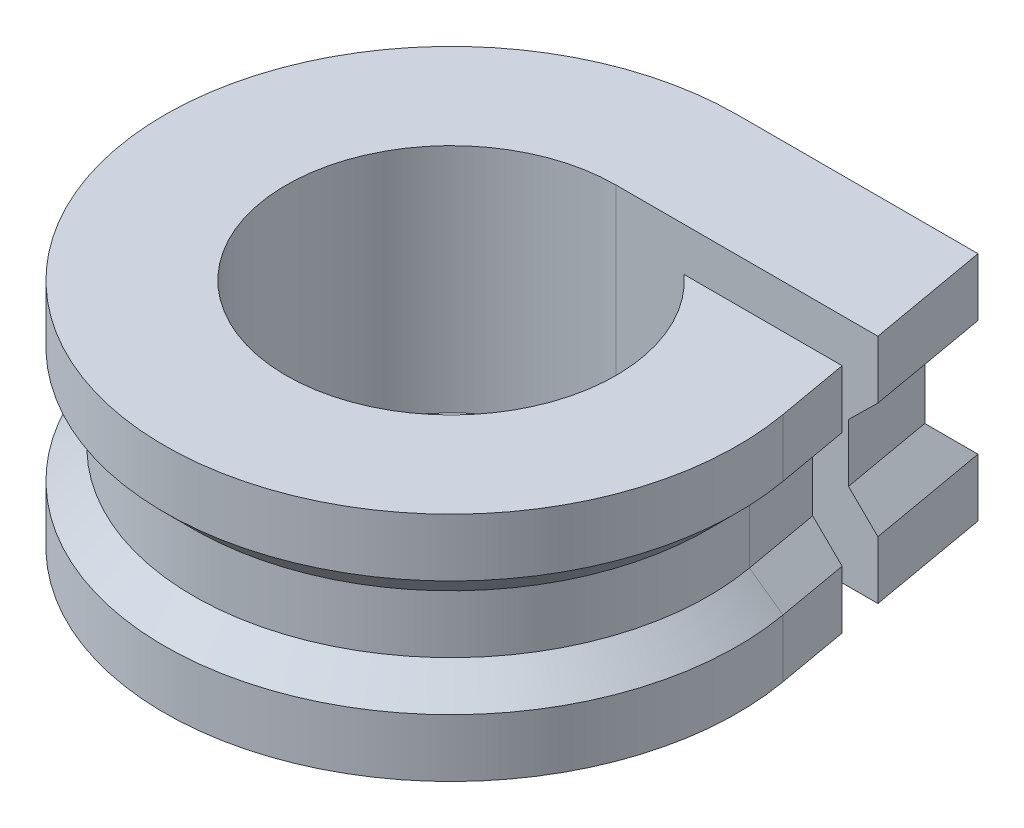
ISO-10303-21;
HEADER;
FILE_DESCRIPTION(('STEP AP214'),'2;1');
FILE_NAME('part.step','',(''),(''),'','','');
FILE_SCHEMA(('AUTOMOTIVE_DESIGN { 1 0 10303 214 1 1 1 1 }'));
ENDSEC;
DATA;
#1=APPLICATION_CONTEXT('core data for automotive mechanical design processes');
#2=APPLICATION_PROTOCOL_DEFINITION('international standard','automotive_design',2000,#1);
#3=PRODUCT_CONTEXT('',#1,'mechanical');
#4=PRODUCT('Part','Part','',(#3));
#5=PRODUCT_RELATED_PRODUCT_CATEGORY('part','',(#4));
#6=PRODUCT_DEFINITION_FORMATION('','',#4);
#7=PRODUCT_DEFINITION_CONTEXT('part definition',#1,'design');
#8=PRODUCT_DEFINITION('design','',#6,#7);
#9=PRODUCT_DEFINITION_SHAPE('','',#8);
#10=(LENGTH_UNIT() NAMED_UNIT(*) SI_UNIT(.MILLI.,.METRE.));
#11=(NAMED_UNIT(*) PLANE_ANGLE_UNIT() SI_UNIT($,.RADIAN.));
#12=(NAMED_UNIT(*) SI_UNIT($,.STERADIAN.) SOLID_ANGLE_UNIT());
#13=UNCERTAINTY_MEASURE_WITH_UNIT(LENGTH_MEASURE(1.E-05),#10,'distance_accuracy_value','');
#14=(GEOMETRIC_REPRESENTATION_CONTEXT(3) GLOBAL_UNCERTAINTY_ASSIGNED_CONTEXT((#13)) GLOBAL_UNIT_ASSIGNED_CONTEXT((#10,
#11,#12)) REPRESENTATION_CONTEXT('',''));
#15=CARTESIAN_POINT('',(0.,0.,0.));
#16=DIRECTION('',(0.,0.,1.));
#17=DIRECTION('',(1.,0.,0.));
#18=AXIS2_PLACEMENT_3D('',#15,#16,#17);
#19=CARTESIAN_POINT('',(0.,3.,-9.9));
#20=DIRECTION('',(0.,0.,-1.));
#21=DIRECTION('',(-1.,0.,0.));
#22=AXIS2_PLACEMENT_3D('',#19,#20,#21);
#23=PLANE('',#22);
#24=DIRECTION('',(0.,-1.,0.));
#25=VECTOR('',#24,1.);
#26=CARTESIAN_POINT('',(0.,3.,-9.9));
#27=LINE('',#26,#25);
#28=CARTESIAN_POINT('',(0.,1.99999999999999,-9.9));
#29=VERTEX_POINT('',#28);
#30=CARTESIAN_POINT('',(0.,0.,-9.9));
#31=VERTEX_POINT('',#30);
#32=EDGE_CURVE('E261',#29,#31,#27,.T.);
#33=ORIENTED_EDGE('',*,*,#32,.F.);
#34=DIRECTION('',(1.,0.,0.));
#35=VECTOR('',#34,1.);
#36=CARTESIAN_POINT('',(0.,1.99999999999999,-9.9));
#37=LINE('',#36,#35);
#38=CARTESIAN_POINT('',(8.3070863486551,1.99999999999999,-9.9));
#39=VERTEX_POINT('',#38);
#40=EDGE_CURVE('E275',#29,#39,#37,.T.);
#41=ORIENTED_EDGE('',*,*,#40,.T.);
#42=DIRECTION('',(0.,-1.,0.));
#43=VECTOR('',#42,1.);
#44=CARTESIAN_POINT('',(8.3070863486551,3.,-9.9));
#45=LINE('',#44,#43);
#46=CARTESIAN_POINT('',(8.3070863486551,0.,-9.9));
#47=VERTEX_POINT('',#46);
#48=EDGE_CURVE('E249',#39,#47,#45,.T.);
#49=ORIENTED_EDGE('',*,*,#48,.T.);
#50=DIRECTION('',(1.,0.,0.));
#51=VECTOR('',#50,1.);
#52=CARTESIAN_POINT('',(0.,0.,-9.9));
#53=LINE('',#52,#51);
#54=EDGE_CURVE('E230',#31,#47,#53,.T.);
#55=ORIENTED_EDGE('',*,*,#54,.F.);
#56=EDGE_LOOP('',(#33,#41,#49,#55));
#57=FACE_BOUND('',#56,.T.);
#58=ADVANCED_FACE('F41',(#57),#23,.T.);
#59=CARTESIAN_POINT('',(0.,3.,0.));
#60=DIRECTION('',(0.,-1.,0.));
#61=DIRECTION('',(0.,0.,-1.));
#62=AXIS2_PLACEMENT_3D('',#59,#60,#61);
#63=CYLINDRICAL_SURFACE('',#62,9.9);
#64=DIRECTION('',(0.,-1.,0.));
#65=VECTOR('',#64,1.);
#66=CARTESIAN_POINT('',(9.74959675482087,3.,-1.71911695890258));
#67=LINE('',#66,#65);
#68=CARTESIAN_POINT('',(9.74959675482087,1.99999999999999,-1.71911695890258));
#69=VERTEX_POINT('',#68);
#70=CARTESIAN_POINT('',(9.74959675482087,0.,-1.71911695890258));
#71=VERTEX_POINT('',#70);
#72=EDGE_CURVE('E259',#69,#71,#67,.T.);
#73=ORIENTED_EDGE('',*,*,#72,.F.);
#74=CARTESIAN_POINT('',(0.,1.99999999999999,0.));
#75=DIRECTION('',(0.,1.,0.));
#76=DIRECTION('',(0.,0.,1.));
#77=AXIS2_PLACEMENT_3D('',#74,#75,#76);
#78=CIRCLE('',#77,9.9);
#79=EDGE_CURVE('E11',#69,#29,#78,.F.);
#80=ORIENTED_EDGE('',*,*,#79,.T.);
#81=ORIENTED_EDGE('',*,*,#32,.T.);
#82=CARTESIAN_POINT('',(0.,0.,0.));
#83=DIRECTION('',(0.,1.,0.));
#84=DIRECTION('',(0.,0.,1.));
#85=AXIS2_PLACEMENT_3D('',#82,#83,#84);
#86=CIRCLE('',#85,9.9);
#87=EDGE_CURVE('E233',#31,#71,#86,.T.);
#88=ORIENTED_EDGE('',*,*,#87,.T.);
#89=EDGE_LOOP('',(#73,#80,#81,#88));
#90=FACE_BOUND('',#89,.T.);
#91=ADVANCED_FACE('F378',(#90),#63,.T.);
#92=CARTESIAN_POINT('',(9.74959675482087,3.,-1.71911695890258));
#93=DIRECTION('',(0.984807753012208,0.,-0.173648177666927));
#94=DIRECTION('',(-0.173648177666927,0.,-0.984807753012209));
#95=AXIS2_PLACEMENT_3D('',#92,#93,#94);
#96=PLANE('',#95);
#97=DIRECTION('',(0.,-1.,0.));
#98=VECTOR('',#97,1.);
#99=CARTESIAN_POINT('',(9.31215013869334,3.,-4.2));
#100=LINE('',#99,#98);
#101=CARTESIAN_POINT('',(9.31215013869334,1.99999999999999,-4.2));
#102=VERTEX_POINT('',#101);
#103=CARTESIAN_POINT('',(9.31215013869334,0.,-4.2));
#104=VERTEX_POINT('',#103);
#105=EDGE_CURVE('E257',#102,#104,#100,.T.);
#106=ORIENTED_EDGE('',*,*,#105,.F.);
#107=DIRECTION('',(0.173648177666927,0.,0.984807753012209));
#108=VECTOR('',#107,1.);
#109=CARTESIAN_POINT('',(9.74959675482087,1.99999999999999,-1.71911695890258));
#110=LINE('',#109,#108);
#111=EDGE_CURVE('E59',#102,#69,#110,.T.);
#112=ORIENTED_EDGE('',*,*,#111,.T.);
#113=ORIENTED_EDGE('',*,*,#72,.T.);
#114=DIRECTION('',(0.173648177666927,0.,0.984807753012209));
#115=VECTOR('',#114,1.);
#116=CARTESIAN_POINT('',(9.74959675482087,0.,-1.71911695890258));
#117=LINE('',#116,#115);
#118=EDGE_CURVE('E236',#104,#71,#117,.T.);
#119=ORIENTED_EDGE('',*,*,#118,.F.);
#120=EDGE_LOOP('',(#106,#112,#113,#119));
#121=FACE_BOUND('',#120,.T.);
#122=ADVANCED_FACE('F380',(#121),#96,.T.);
#123=CARTESIAN_POINT('',(0.,3.,-4.2));
#124=DIRECTION('',(0.,0.,-1.));
#125=DIRECTION('',(-1.,0.,0.));
#126=AXIS2_PLACEMENT_3D('',#123,#124,#125);
#127=PLANE('',#126);
#128=DIRECTION('',(0.,-1.,0.));
#129=VECTOR('',#128,1.);
#130=CARTESIAN_POINT('',(3.85356977359954,3.,-4.2));
#131=LINE('',#130,#129);
#132=CARTESIAN_POINT('',(3.85356977359954,8.,-4.2));
#133=VERTEX_POINT('',#132);
#134=CARTESIAN_POINT('',(3.85356977359954,0.,-4.2));
#135=VERTEX_POINT('',#134);
#136=EDGE_CURVE('E255',#133,#135,#131,.T.);
#137=ORIENTED_EDGE('',*,*,#136,.F.);
#138=DIRECTION('',(1.,0.,0.));
#139=VECTOR('',#138,1.);
#140=CARTESIAN_POINT('',(0.,8.,-4.2));
#141=LINE('',#140,#139);
#142=CARTESIAN_POINT('',(9.31215013869334,8.,-4.2));
#143=VERTEX_POINT('',#142);
#144=EDGE_CURVE('E331',#133,#143,#141,.T.);
#145=ORIENTED_EDGE('',*,*,#144,.T.);
#146=DIRECTION('',(0.,1.,0.));
#147=VECTOR('',#146,1.);
#148=CARTESIAN_POINT('',(9.31215013869334,5.,-4.2));
#149=LINE('',#148,#147);
#150=CARTESIAN_POINT('',(9.31215013869334,6.00000000000001,-4.2));
#151=VERTEX_POINT('',#150);
#152=EDGE_CURVE('E301',#151,#143,#149,.T.);
#153=ORIENTED_EDGE('',*,*,#152,.F.);
#154=DIRECTION('',(-0.712498293208668,-0.701673843159865,0.));
#155=VECTOR('',#154,1.);
#156=CARTESIAN_POINT('',(4.08486015298302,0.852124294829388,-4.2));
#157=LINE('',#156,#155);
#158=CARTESIAN_POINT('',(8.29672352680759,5.,-4.2));
#159=VERTEX_POINT('',#158);
#160=EDGE_CURVE('E206',#159,#151,#157,.F.);
#161=ORIENTED_EDGE('',*,*,#160,.F.);
#162=DIRECTION('',(0.,-1.,0.));
#163=VECTOR('',#162,1.);
#164=CARTESIAN_POINT('',(8.29672352680759,4.,-4.2));
#165=LINE('',#164,#163);
#166=CARTESIAN_POINT('',(8.29672352680759,3.,-4.2));
#167=VERTEX_POINT('',#166);
#168=EDGE_CURVE('E211',#159,#167,#165,.T.);
#169=ORIENTED_EDGE('',*,*,#168,.T.);
#170=DIRECTION('',(-0.712498293208668,0.701673843159865,0.));
#171=VECTOR('',#170,1.);
#172=CARTESIAN_POINT('',(4.08486015298302,7.14787570517061,-4.2));
#173=LINE('',#172,#171);
#174=EDGE_CURVE('E51',#167,#102,#173,.F.);
#175=ORIENTED_EDGE('',*,*,#174,.T.);
#176=ORIENTED_EDGE('',*,*,#105,.T.);
#177=DIRECTION('',(1.,0.,0.));
#178=VECTOR('',#177,1.);
#179=CARTESIAN_POINT('',(0.,0.,-4.2));
#180=LINE('',#179,#178);
#181=EDGE_CURVE('E239',#135,#104,#180,.T.);
#182=ORIENTED_EDGE('',*,*,#181,.F.);
#183=EDGE_LOOP('',(#137,#145,#153,#161,#169,#175,#176,#182));
#184=FACE_BOUND('',#183,.T.);
#185=ADVANCED_FACE('F298',(#184),#127,.T.);
#186=CARTESIAN_POINT('',(0.,3.,0.));
#187=DIRECTION('',(0.,-1.,0.));
#188=DIRECTION('',(0.,0.,-1.));
#189=AXIS2_PLACEMENT_3D('',#186,#187,#188);
#190=CYLINDRICAL_SURFACE('',#189,5.7);
#191=CARTESIAN_POINT('',(0.,0.,0.));
#192=DIRECTION('',(0.,1.,0.));
#193=DIRECTION('',(0.,0.,1.));
#194=AXIS2_PLACEMENT_3D('',#191,#192,#193);
#195=CIRCLE('',#194,5.7);
#196=CARTESIAN_POINT('',(0.,0.,-5.7));
#197=VERTEX_POINT('',#196);
#198=EDGE_CURVE('E243',#197,#135,#195,.T.);
#199=ORIENTED_EDGE('',*,*,#198,.F.);
#200=DIRECTION('',(0.,-1.,0.));
#201=VECTOR('',#200,1.);
#202=CARTESIAN_POINT('',(0.,3.,-5.7));
#203=LINE('',#202,#201);
#204=CARTESIAN_POINT('',(0.,8.,-5.7));
#205=VERTEX_POINT('',#204);
#206=EDGE_CURVE('E253',#205,#197,#203,.T.);
#207=ORIENTED_EDGE('',*,*,#206,.F.);
#208=CARTESIAN_POINT('',(0.,8.,0.));
#209=DIRECTION('',(0.,1.,0.));
#210=DIRECTION('',(0.,0.,1.));
#211=AXIS2_PLACEMENT_3D('',#208,#209,#210);
#212=CIRCLE('',#211,5.7);
#213=EDGE_CURVE('E328',#205,#133,#212,.T.);
#214=ORIENTED_EDGE('',*,*,#213,.T.);
#215=ORIENTED_EDGE('',*,*,#136,.T.);
#216=EDGE_LOOP('',(#199,#207,#214,#215));
#217=FACE_BOUND('',#216,.T.);
#218=ADVANCED_FACE('F384',(#217),#190,.F.);
#219=CARTESIAN_POINT('',(0.,3.,-5.7));
#220=DIRECTION('',(0.,0.,-1.));
#221=DIRECTION('',(-1.,0.,0.));
#222=AXIS2_PLACEMENT_3D('',#219,#220,#221);
#223=PLANE('',#222);
#224=DIRECTION('',(0.,-1.,0.));
#225=VECTOR('',#224,1.);
#226=CARTESIAN_POINT('',(9.04765966763064,3.,-5.7));
#227=LINE('',#226,#225);
#228=CARTESIAN_POINT('',(9.04765966763064,2.,-5.7));
#229=VERTEX_POINT('',#228);
#230=CARTESIAN_POINT('',(9.04765966763064,0.,-5.7));
#231=VERTEX_POINT('',#230);
#232=EDGE_CURVE('E251',#229,#231,#227,.T.);
#233=ORIENTED_EDGE('',*,*,#232,.F.);
#234=DIRECTION('',(0.71249829320867,-0.701673843159863,0.));
#235=VECTOR('',#234,1.);
#236=CARTESIAN_POINT('',(9.40400070981591,1.6490725789395,-5.7));
#237=LINE('',#236,#235);
#238=CARTESIAN_POINT('',(8.0322330557449,3.,-5.7));
#239=VERTEX_POINT('',#238);
#240=EDGE_CURVE('E170',#229,#239,#237,.F.);
#241=ORIENTED_EDGE('',*,*,#240,.T.);
#242=DIRECTION('',(0.,-1.,0.));
#243=VECTOR('',#242,1.);
#244=CARTESIAN_POINT('',(8.0322330557449,4.,-5.7));
#245=LINE('',#244,#243);
#246=CARTESIAN_POINT('',(8.0322330557449,5.,-5.7));
#247=VERTEX_POINT('',#246);
#248=EDGE_CURVE('E162',#247,#239,#245,.T.);
#249=ORIENTED_EDGE('',*,*,#248,.F.);
#250=DIRECTION('',(0.71249829320867,0.701673843159863,0.));
#251=VECTOR('',#250,1.);
#252=CARTESIAN_POINT('',(9.40400070981591,6.3509274210605,-5.7));
#253=LINE('',#252,#251);
#254=CARTESIAN_POINT('',(9.04765966763064,6.,-5.7));
#255=VERTEX_POINT('',#254);
#256=EDGE_CURVE('E168',#255,#247,#253,.F.);
#257=ORIENTED_EDGE('',*,*,#256,.F.);
#258=DIRECTION('',(0.,1.,0.));
#259=VECTOR('',#258,1.);
#260=CARTESIAN_POINT('',(9.04765966763064,5.,-5.7));
#261=LINE('',#260,#259);
#262=CARTESIAN_POINT('',(9.04765966763064,8.,-5.7));
#263=VERTEX_POINT('',#262);
#264=EDGE_CURVE('E317',#255,#263,#261,.T.);
#265=ORIENTED_EDGE('',*,*,#264,.T.);
#266=DIRECTION('',(1.,0.,0.));
#267=VECTOR('',#266,1.);
#268=CARTESIAN_POINT('',(0.,8.,-5.7));
#269=LINE('',#268,#267);
#270=EDGE_CURVE('E325',#205,#263,#269,.T.);
#271=ORIENTED_EDGE('',*,*,#270,.F.);
#272=ORIENTED_EDGE('',*,*,#206,.T.);
#273=DIRECTION('',(1.,0.,0.));
#274=VECTOR('',#273,1.);
#275=CARTESIAN_POINT('',(0.,0.,-5.7));
#276=LINE('',#275,#274);
#277=EDGE_CURVE('E246',#197,#231,#276,.T.);
#278=ORIENTED_EDGE('',*,*,#277,.T.);
#279=EDGE_LOOP('',(#233,#241,#249,#257,#265,#271,#272,#278));
#280=FACE_BOUND('',#279,.T.);
#281=ADVANCED_FACE('F165',(#280),#223,.F.);
#282=ORIENTED_EDGE('',*,*,#48,.F.);
#283=DIRECTION('',(0.173648177666927,0.,0.984807753012209));
#284=VECTOR('',#283,1.);
#285=CARTESIAN_POINT('',(9.74959675482087,2.,-1.71911695890258));
#286=LINE('',#285,#284);
#287=EDGE_CURVE('E263',#39,#229,#286,.T.);
#288=ORIENTED_EDGE('',*,*,#287,.T.);
#289=ORIENTED_EDGE('',*,*,#232,.T.);
#290=EDGE_CURVE('E240',#47,#231,#117,.T.);
#291=ORIENTED_EDGE('',*,*,#290,.F.);
#292=EDGE_LOOP('',(#282,#288,#289,#291));
#293=FACE_BOUND('',#292,.T.);
#294=ADVANCED_FACE('F366',(#293),#96,.T.);
#295=CARTESIAN_POINT('',(0.,0.,0.));
#296=DIRECTION('',(0.,1.,0.));
#297=DIRECTION('',(0.,0.,1.));
#298=AXIS2_PLACEMENT_3D('',#295,#296,#297);
#299=PLANE('',#298);
#300=ORIENTED_EDGE('',*,*,#54,.T.);
#301=ORIENTED_EDGE('',*,*,#290,.T.);
#302=ORIENTED_EDGE('',*,*,#277,.F.);
#303=ORIENTED_EDGE('',*,*,#198,.T.);
#304=ORIENTED_EDGE('',*,*,#181,.T.);
#305=ORIENTED_EDGE('',*,*,#118,.T.);
#306=ORIENTED_EDGE('',*,*,#87,.F.);
#307=EDGE_LOOP('',(#300,#301,#302,#303,#304,#305,#306));
#308=FACE_BOUND('',#307,.T.);
#309=ADVANCED_FACE('F372',(#308),#299,.F.);
#310=CARTESIAN_POINT('',(9.74959675482087,1.99999999999999,-1.71911695890258));
#311=DIRECTION('',(-0.696364240320021,-0.707106781186546,0.122787803968971));
#312=DIRECTION('',(0.173648177666927,0.,0.984807753012209));
#313=AXIS2_PLACEMENT_3D('',#310,#311,#312);
#314=PLANE('',#313);
#315=ORIENTED_EDGE('',*,*,#174,.F.);
#316=DIRECTION('',(-0.173648177666927,0.,-0.984807753012209));
#317=VECTOR('',#316,1.);
#318=CARTESIAN_POINT('',(8.76478900180866,3.,-1.54546878123565));
#319=LINE('',#318,#317);
#320=CARTESIAN_POINT('',(8.76478900180865,3.,-1.54546878123566));
#321=VERTEX_POINT('',#320);
#322=EDGE_CURVE('E269',#321,#167,#319,.T.);
#323=ORIENTED_EDGE('',*,*,#322,.F.);
#324=DIRECTION('',(-0.696364240320018,0.707106781186549,0.12278780396897));
#325=VECTOR('',#324,1.);
#326=CARTESIAN_POINT('',(9.74959675482087,1.99999999999999,-1.71911695890258));
#327=LINE('',#326,#325);
#328=EDGE_CURVE('E46',#69,#321,#327,.T.);
#329=ORIENTED_EDGE('',*,*,#328,.F.);
#330=ORIENTED_EDGE('',*,*,#111,.F.);
#331=EDGE_LOOP('',(#315,#323,#329,#330));
#332=FACE_BOUND('',#331,.T.);
#333=ADVANCED_FACE('F44',(#332),#314,.F.);
#334=CARTESIAN_POINT('',(0.,3.,0.));
#335=DIRECTION('',(0.,-1.,0.));
#336=DIRECTION('',(0.,0.,-1.));
#337=AXIS2_PLACEMENT_3D('',#334,#335,#336);
#338=CONICAL_SURFACE('',#337,8.9,0.785398163397447);
#339=ORIENTED_EDGE('',*,*,#328,.T.);
#340=CARTESIAN_POINT('',(0.,3.,0.));
#341=DIRECTION('',(0.,1.,0.));
#342=DIRECTION('',(0.,0.,1.));
#343=AXIS2_PLACEMENT_3D('',#340,#341,#342);
#344=CIRCLE('',#343,8.9);
#345=CARTESIAN_POINT('',(0.,3.,-8.9));
#346=VERTEX_POINT('',#345);
#347=EDGE_CURVE('E267',#346,#321,#344,.T.);
#348=ORIENTED_EDGE('',*,*,#347,.F.);
#349=DIRECTION('',(0.,0.707106781186548,0.707106781186547));
#350=VECTOR('',#349,1.);
#351=CARTESIAN_POINT('',(0.,1.99999999999999,-9.9));
#352=LINE('',#351,#350);
#353=EDGE_CURVE('E280',#29,#346,#352,.T.);
#354=ORIENTED_EDGE('',*,*,#353,.F.);
#355=ORIENTED_EDGE('',*,*,#79,.F.);
#356=EDGE_LOOP('',(#339,#348,#354,#355));
#357=FACE_BOUND('',#356,.T.);
#358=ADVANCED_FACE('F291',(#357),#338,.T.);
#359=CARTESIAN_POINT('',(0.,1.99999999999999,-9.9));
#360=DIRECTION('',(0.,-0.707106781186547,0.707106781186548));
#361=DIRECTION('',(1.,0.,0.));
#362=AXIS2_PLACEMENT_3D('',#359,#360,#361);
#363=PLANE('',#362);
#364=ORIENTED_EDGE('',*,*,#353,.T.);
#365=DIRECTION('',(-1.,0.,0.));
#366=VECTOR('',#365,1.);
#367=CARTESIAN_POINT('',(0.,3.,-8.9));
#368=LINE('',#367,#366);
#369=CARTESIAN_POINT('',(7.46798671747782,3.,-8.9));
#370=VERTEX_POINT('',#369);
#371=EDGE_CURVE('E271',#370,#346,#368,.T.);
#372=ORIENTED_EDGE('',*,*,#371,.F.);
#373=DIRECTION('',(0.510273605374739,-0.608120402411342,-0.608120402411341));
#374=VECTOR('',#373,1.);
#375=CARTESIAN_POINT('',(6.14409424675937,4.57775360818713,-7.32224639181287));
#376=LINE('',#375,#374);
#377=EDGE_CURVE('E173',#39,#370,#376,.F.);
#378=ORIENTED_EDGE('',*,*,#377,.F.);
#379=ORIENTED_EDGE('',*,*,#40,.F.);
#380=EDGE_LOOP('',(#364,#372,#378,#379));
#381=FACE_BOUND('',#380,.T.);
#382=ADVANCED_FACE('F360',(#381),#363,.F.);
#383=CARTESIAN_POINT('',(9.74959675482087,2.,-1.71911695890258));
#384=DIRECTION('',(-0.696364240320019,-0.707106781186548,0.12278780396897));
#385=DIRECTION('',(0.173648177666927,0.,0.984807753012209));
#386=AXIS2_PLACEMENT_3D('',#383,#384,#385);
#387=PLANE('',#386);
#388=ORIENTED_EDGE('',*,*,#377,.T.);
#389=DIRECTION('',(-0.173648177666927,0.,-0.984807753012209));
#390=VECTOR('',#389,1.);
#391=CARTESIAN_POINT('',(8.76478900180866,3.,-1.54546878123565));
#392=LINE('',#391,#390);
#393=EDGE_CURVE('E273',#239,#370,#392,.T.);
#394=ORIENTED_EDGE('',*,*,#393,.F.);
#395=ORIENTED_EDGE('',*,*,#240,.F.);
#396=ORIENTED_EDGE('',*,*,#287,.F.);
#397=EDGE_LOOP('',(#388,#394,#395,#396));
#398=FACE_BOUND('',#397,.T.);
#399=ADVANCED_FACE('F363',(#398),#387,.F.);
#400=CARTESIAN_POINT('',(8.0322330557449,4.,-5.7));
#401=DIRECTION('',(-0.984807753012209,0.,0.173648177666927));
#402=DIRECTION('',(0.173648177666927,0.,0.984807753012209));
#403=AXIS2_PLACEMENT_3D('',#400,#401,#402);
#404=PLANE('',#403);
#405=ORIENTED_EDGE('',*,*,#393,.T.);
#406=DIRECTION('',(0.,-1.,0.));
#407=VECTOR('',#406,1.);
#408=CARTESIAN_POINT('',(7.46798671747782,4.,-8.9));
#409=LINE('',#408,#407);
#410=CARTESIAN_POINT('',(7.46798671747782,5.,-8.9));
#411=VERTEX_POINT('',#410);
#412=EDGE_CURVE('E174',#411,#370,#409,.T.);
#413=ORIENTED_EDGE('',*,*,#412,.F.);
#414=DIRECTION('',(-0.173648177666927,0.,-0.984807753012209));
#415=VECTOR('',#414,1.);
#416=CARTESIAN_POINT('',(8.76478900180866,5.,-1.54546878123565));
#417=LINE('',#416,#415);
#418=EDGE_CURVE('E177',#247,#411,#417,.T.);
#419=ORIENTED_EDGE('',*,*,#418,.F.);
#420=ORIENTED_EDGE('',*,*,#248,.T.);
#421=EDGE_LOOP('',(#405,#413,#419,#420));
#422=FACE_BOUND('',#421,.T.);
#423=ADVANCED_FACE('F178',(#422),#404,.F.);
#424=CARTESIAN_POINT('',(7.46798671747782,4.,-8.9));
#425=DIRECTION('',(0.,0.,1.));
#426=DIRECTION('',(1.,0.,0.));
#427=AXIS2_PLACEMENT_3D('',#424,#425,#426);
#428=PLANE('',#427);
#429=ORIENTED_EDGE('',*,*,#371,.T.);
#430=DIRECTION('',(0.,-1.,0.));
#431=VECTOR('',#430,1.);
#432=CARTESIAN_POINT('',(0.,4.,-8.9));
#433=LINE('',#432,#431);
#434=CARTESIAN_POINT('',(0.,5.,-8.9));
#435=VERTEX_POINT('',#434);
#436=EDGE_CURVE('E226',#435,#346,#433,.T.);
#437=ORIENTED_EDGE('',*,*,#436,.F.);
#438=DIRECTION('',(-1.,0.,0.));
#439=VECTOR('',#438,1.);
#440=CARTESIAN_POINT('',(0.,5.,-8.9));
#441=LINE('',#440,#439);
#442=EDGE_CURVE('E183',#411,#435,#441,.T.);
#443=ORIENTED_EDGE('',*,*,#442,.F.);
#444=ORIENTED_EDGE('',*,*,#412,.T.);
#445=EDGE_LOOP('',(#429,#437,#443,#444));
#446=FACE_BOUND('',#445,.T.);
#447=ADVANCED_FACE('F358',(#446),#428,.F.);
#448=CARTESIAN_POINT('',(0.,4.,0.));
#449=DIRECTION('',(0.,-1.,0.));
#450=DIRECTION('',(0.,0.,-1.));
#451=AXIS2_PLACEMENT_3D('',#448,#449,#450);
#452=CYLINDRICAL_SURFACE('',#451,8.9);
#453=ORIENTED_EDGE('',*,*,#347,.T.);
#454=DIRECTION('',(0.,-1.,0.));
#455=VECTOR('',#454,1.);
#456=CARTESIAN_POINT('',(8.76478900180865,4.,-1.54546878123566));
#457=LINE('',#456,#455);
#458=CARTESIAN_POINT('',(8.76478900180865,5.,-1.54546878123566));
#459=VERTEX_POINT('',#458);
#460=EDGE_CURVE('E223',#459,#321,#457,.T.);
#461=ORIENTED_EDGE('',*,*,#460,.F.);
#462=CARTESIAN_POINT('',(0.,5.,0.));
#463=DIRECTION('',(0.,1.,0.));
#464=DIRECTION('',(0.,0.,1.));
#465=AXIS2_PLACEMENT_3D('',#462,#463,#464);
#466=CIRCLE('',#465,8.9);
#467=EDGE_CURVE('E188',#435,#459,#466,.T.);
#468=ORIENTED_EDGE('',*,*,#467,.F.);
#469=ORIENTED_EDGE('',*,*,#436,.T.);
#470=EDGE_LOOP('',(#453,#461,#468,#469));
#471=FACE_BOUND('',#470,.T.);
#472=ADVANCED_FACE('F356',(#471),#452,.T.);
#473=CARTESIAN_POINT('',(8.76478900180865,4.,-1.54546878123565));
#474=DIRECTION('',(-0.984807753012209,0.,0.173648177666925));
#475=DIRECTION('',(0.173648177666925,0.,0.984807753012209));
#476=AXIS2_PLACEMENT_3D('',#473,#474,#475);
#477=PLANE('',#476);
#478=ORIENTED_EDGE('',*,*,#322,.T.);
#479=ORIENTED_EDGE('',*,*,#168,.F.);
#480=DIRECTION('',(-0.173648177666927,0.,-0.984807753012209));
#481=VECTOR('',#480,1.);
#482=CARTESIAN_POINT('',(8.76478900180866,5.,-1.54546878123565));
#483=LINE('',#482,#481);
#484=EDGE_CURVE('E191',#459,#159,#483,.T.);
#485=ORIENTED_EDGE('',*,*,#484,.F.);
#486=ORIENTED_EDGE('',*,*,#460,.T.);
#487=EDGE_LOOP('',(#478,#479,#485,#486));
#488=FACE_BOUND('',#487,.T.);
#489=ADVANCED_FACE('F295',(#488),#477,.F.);
#490=CARTESIAN_POINT('',(0.,5.,-9.9));
#491=DIRECTION('',(0.,0.,-1.));
#492=DIRECTION('',(-1.,0.,0.));
#493=AXIS2_PLACEMENT_3D('',#490,#491,#492);
#494=PLANE('',#493);
#495=DIRECTION('',(0.,1.,0.));
#496=VECTOR('',#495,1.);
#497=CARTESIAN_POINT('',(0.,5.,-9.9));
#498=LINE('',#497,#496);
#499=CARTESIAN_POINT('',(0.,6.00000000000001,-9.9));
#500=VERTEX_POINT('',#499);
#501=CARTESIAN_POINT('',(0.,8.,-9.9));
#502=VERTEX_POINT('',#501);
#503=EDGE_CURVE('E193',#500,#502,#498,.T.);
#504=ORIENTED_EDGE('',*,*,#503,.T.);
#505=DIRECTION('',(1.,0.,0.));
#506=VECTOR('',#505,1.);
#507=CARTESIAN_POINT('',(0.,8.,-9.9));
#508=LINE('',#507,#506);
#509=CARTESIAN_POINT('',(8.3070863486551,8.,-9.9));
#510=VERTEX_POINT('',#509);
#511=EDGE_CURVE('E221',#502,#510,#508,.T.);
#512=ORIENTED_EDGE('',*,*,#511,.T.);
#513=DIRECTION('',(0.,1.,0.));
#514=VECTOR('',#513,1.);
#515=CARTESIAN_POINT('',(8.3070863486551,5.,-9.9));
#516=LINE('',#515,#514);
#517=CARTESIAN_POINT('',(8.3070863486551,6.00000000000001,-9.9));
#518=VERTEX_POINT('',#517);
#519=EDGE_CURVE('E321',#518,#510,#516,.T.);
#520=ORIENTED_EDGE('',*,*,#519,.F.);
#521=DIRECTION('',(1.,0.,0.));
#522=VECTOR('',#521,1.);
#523=CARTESIAN_POINT('',(0.,6.00000000000001,-9.9));
#524=LINE('',#523,#522);
#525=EDGE_CURVE('E182',#500,#518,#524,.T.);
#526=ORIENTED_EDGE('',*,*,#525,.F.);
#527=EDGE_LOOP('',(#504,#512,#520,#526));
#528=FACE_BOUND('',#527,.T.);
#529=ADVANCED_FACE('F340',(#528),#494,.T.);
#530=CARTESIAN_POINT('',(0.,5.,0.));
#531=DIRECTION('',(0.,1.,0.));
#532=DIRECTION('',(0.,0.,-1.));
#533=AXIS2_PLACEMENT_3D('',#530,#531,#532);
#534=CYLINDRICAL_SURFACE('',#533,9.9);
#535=DIRECTION('',(0.,1.,0.));
#536=VECTOR('',#535,1.);
#537=CARTESIAN_POINT('',(9.74959675482087,5.,-1.71911695890258));
#538=LINE('',#537,#536);
#539=CARTESIAN_POINT('',(9.74959675482087,6.00000000000001,-1.71911695890258));
#540=VERTEX_POINT('',#539);
#541=CARTESIAN_POINT('',(9.74959675482087,8.,-1.71911695890258));
#542=VERTEX_POINT('',#541);
#543=EDGE_CURVE('E310',#540,#542,#538,.T.);
#544=ORIENTED_EDGE('',*,*,#543,.T.);
#545=CARTESIAN_POINT('',(0.,8.,0.));
#546=DIRECTION('',(0.,1.,0.));
#547=DIRECTION('',(0.,0.,1.));
#548=AXIS2_PLACEMENT_3D('',#545,#546,#547);
#549=CIRCLE('',#548,9.9);
#550=EDGE_CURVE('E334',#502,#542,#549,.T.);
#551=ORIENTED_EDGE('',*,*,#550,.F.);
#552=ORIENTED_EDGE('',*,*,#503,.F.);
#553=CARTESIAN_POINT('',(0.,6.00000000000001,0.));
#554=DIRECTION('',(0.,1.,0.));
#555=DIRECTION('',(0.,0.,1.));
#556=AXIS2_PLACEMENT_3D('',#553,#554,#555);
#557=CIRCLE('',#556,9.9);
#558=EDGE_CURVE('E208',#540,#500,#557,.F.);
#559=ORIENTED_EDGE('',*,*,#558,.F.);
#560=EDGE_LOOP('',(#544,#551,#552,#559));
#561=FACE_BOUND('',#560,.T.);
#562=ADVANCED_FACE('F351',(#561),#534,.T.);
#563=CARTESIAN_POINT('',(9.74959675482087,5.,-1.71911695890258));
#564=DIRECTION('',(0.984807753012208,0.,-0.173648177666927));
#565=DIRECTION('',(-0.173648177666927,0.,-0.984807753012209));
#566=AXIS2_PLACEMENT_3D('',#563,#564,#565);
#567=PLANE('',#566);
#568=ORIENTED_EDGE('',*,*,#152,.T.);
#569=DIRECTION('',(0.173648177666927,0.,0.984807753012209));
#570=VECTOR('',#569,1.);
#571=CARTESIAN_POINT('',(9.74959675482087,8.,-1.71911695890258));
#572=LINE('',#571,#570);
#573=EDGE_CURVE('E312',#143,#542,#572,.T.);
#574=ORIENTED_EDGE('',*,*,#573,.T.);
#575=ORIENTED_EDGE('',*,*,#543,.F.);
#576=DIRECTION('',(0.173648177666927,0.,0.984807753012209));
#577=VECTOR('',#576,1.);
#578=CARTESIAN_POINT('',(9.74959675482087,6.00000000000001,-1.71911695890258));
#579=LINE('',#578,#577);
#580=EDGE_CURVE('E203',#151,#540,#579,.T.);
#581=ORIENTED_EDGE('',*,*,#580,.F.);
#582=EDGE_LOOP('',(#568,#574,#575,#581));
#583=FACE_BOUND('',#582,.T.);
#584=ADVANCED_FACE('F308',(#583),#567,.T.);
#585=ORIENTED_EDGE('',*,*,#519,.T.);
#586=EDGE_CURVE('E324',#510,#263,#572,.T.);
#587=ORIENTED_EDGE('',*,*,#586,.T.);
#588=ORIENTED_EDGE('',*,*,#264,.F.);
#589=DIRECTION('',(0.173648177666927,0.,0.984807753012209));
#590=VECTOR('',#589,1.);
#591=CARTESIAN_POINT('',(9.74959675482087,6.,-1.71911695890258));
#592=LINE('',#591,#590);
#593=EDGE_CURVE('E187',#518,#255,#592,.T.);
#594=ORIENTED_EDGE('',*,*,#593,.F.);
#595=EDGE_LOOP('',(#585,#587,#588,#594));
#596=FACE_BOUND('',#595,.T.);
#597=ADVANCED_FACE('F348',(#596),#567,.T.);
#598=CARTESIAN_POINT('',(0.,8.,0.));
#599=DIRECTION('',(0.,-1.,0.));
#600=DIRECTION('',(0.,0.,1.));
#601=AXIS2_PLACEMENT_3D('',#598,#599,#600);
#602=PLANE('',#601);
#603=ORIENTED_EDGE('',*,*,#511,.F.);
#604=ORIENTED_EDGE('',*,*,#550,.T.);
#605=ORIENTED_EDGE('',*,*,#573,.F.);
#606=ORIENTED_EDGE('',*,*,#144,.F.);
#607=ORIENTED_EDGE('',*,*,#213,.F.);
#608=ORIENTED_EDGE('',*,*,#270,.T.);
#609=ORIENTED_EDGE('',*,*,#586,.F.);
#610=EDGE_LOOP('',(#603,#604,#605,#606,#607,#608,#609));
#611=FACE_BOUND('',#610,.T.);
#612=ADVANCED_FACE('F344',(#611),#602,.F.);
#613=CARTESIAN_POINT('',(9.74959675482087,6.00000000000001,-1.71911695890258));
#614=DIRECTION('',(-0.696364240320021,0.707106781186546,0.122787803968971));
#615=DIRECTION('',(0.173648177666927,0.,0.984807753012209));
#616=AXIS2_PLACEMENT_3D('',#613,#614,#615);
#617=PLANE('',#616);
#618=ORIENTED_EDGE('',*,*,#160,.T.);
#619=ORIENTED_EDGE('',*,*,#580,.T.);
#620=DIRECTION('',(-0.696364240320018,-0.707106781186549,0.12278780396897));
#621=VECTOR('',#620,1.);
#622=CARTESIAN_POINT('',(9.74959675482087,6.00000000000001,-1.71911695890258));
#623=LINE('',#622,#621);
#624=EDGE_CURVE('E218',#540,#459,#623,.T.);
#625=ORIENTED_EDGE('',*,*,#624,.T.);
#626=ORIENTED_EDGE('',*,*,#484,.T.);
#627=EDGE_LOOP('',(#618,#619,#625,#626));
#628=FACE_BOUND('',#627,.T.);
#629=ADVANCED_FACE('F304',(#628),#617,.F.);
#630=CARTESIAN_POINT('',(0.,5.,0.));
#631=DIRECTION('',(0.,1.,0.));
#632=DIRECTION('',(0.,0.,-1.));
#633=AXIS2_PLACEMENT_3D('',#630,#631,#632);
#634=CONICAL_SURFACE('',#633,8.9,0.785398163397447);
#635=ORIENTED_EDGE('',*,*,#624,.F.);
#636=ORIENTED_EDGE('',*,*,#558,.T.);
#637=DIRECTION('',(0.,-0.707106781186548,0.707106781186547));
#638=VECTOR('',#637,1.);
#639=CARTESIAN_POINT('',(0.,6.00000000000001,-9.9));
#640=LINE('',#639,#638);
#641=EDGE_CURVE('E215',#500,#435,#640,.T.);
#642=ORIENTED_EDGE('',*,*,#641,.T.);
#643=ORIENTED_EDGE('',*,*,#467,.T.);
#644=EDGE_LOOP('',(#635,#636,#642,#643));
#645=FACE_BOUND('',#644,.T.);
#646=ADVANCED_FACE('F353',(#645),#634,.T.);
#647=CARTESIAN_POINT('',(0.,6.00000000000001,-9.9));
#648=DIRECTION('',(0.,0.707106781186547,0.707106781186548));
#649=DIRECTION('',(1.,0.,0.));
#650=AXIS2_PLACEMENT_3D('',#647,#648,#649);
#651=PLANE('',#650);
#652=ORIENTED_EDGE('',*,*,#641,.F.);
#653=ORIENTED_EDGE('',*,*,#525,.T.);
#654=DIRECTION('',(0.510273605374739,0.608120402411342,-0.608120402411341));
#655=VECTOR('',#654,1.);
#656=CARTESIAN_POINT('',(6.14409424675937,3.42224639181287,-7.32224639181287));
#657=LINE('',#656,#655);
#658=EDGE_CURVE('E212',#518,#411,#657,.F.);
#659=ORIENTED_EDGE('',*,*,#658,.T.);
#660=ORIENTED_EDGE('',*,*,#442,.T.);
#661=EDGE_LOOP('',(#652,#653,#659,#660));
#662=FACE_BOUND('',#661,.T.);
#663=ADVANCED_FACE('F350',(#662),#651,.F.);
#664=CARTESIAN_POINT('',(9.74959675482087,6.,-1.71911695890258));
#665=DIRECTION('',(-0.696364240320019,0.707106781186548,0.12278780396897));
#666=DIRECTION('',(0.173648177666927,0.,0.984807753012209));
#667=AXIS2_PLACEMENT_3D('',#664,#665,#666);
#668=PLANE('',#667);
#669=ORIENTED_EDGE('',*,*,#658,.F.);
#670=ORIENTED_EDGE('',*,*,#593,.T.);
#671=ORIENTED_EDGE('',*,*,#256,.T.);
#672=ORIENTED_EDGE('',*,*,#418,.T.);
#673=EDGE_LOOP('',(#669,#670,#671,#672));
#674=FACE_BOUND('',#673,.T.);
#675=ADVANCED_FACE('F185',(#674),#668,.F.);
#676=CLOSED_SHELL('',(#58,#91,#122,#185,#218,#281,#294,#309,#333,#358,#382,#399,#423,#447,#472,
#489,#529,#562,#584,#597,#612,#629,#646,#663,#675));
#677=MANIFOLD_SOLID_BREP('B2',#676);
#678=ADVANCED_BREP_SHAPE_REPRESENTATION('',(#18,#677),#14);
#679=SHAPE_DEFINITION_REPRESENTATION(#9,#678);
ENDSEC;
END-ISO-10303-21;
